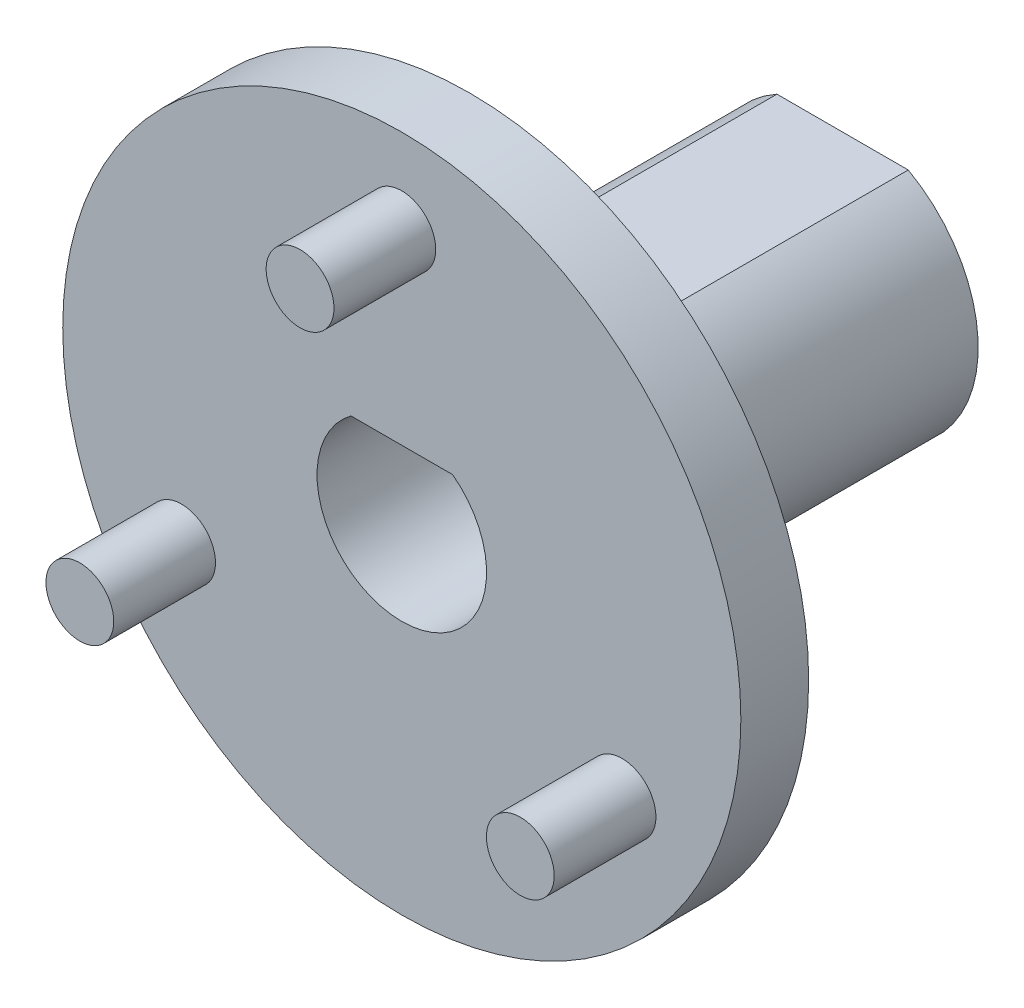
ISO-10303-21;
HEADER;
FILE_DESCRIPTION(('STEP AP214'),'2;1');
FILE_NAME('part.step','',(''),(''),'','','');
FILE_SCHEMA(('AUTOMOTIVE_DESIGN { 1 0 10303 214 1 1 1 1 }'));
ENDSEC;
DATA;
#1=APPLICATION_CONTEXT('core data for automotive mechanical design processes');
#2=APPLICATION_PROTOCOL_DEFINITION('international standard','automotive_design',2000,#1);
#3=PRODUCT_CONTEXT('',#1,'mechanical');
#4=PRODUCT('Part','Part','',(#3));
#5=PRODUCT_RELATED_PRODUCT_CATEGORY('part','',(#4));
#6=PRODUCT_DEFINITION_FORMATION('','',#4);
#7=PRODUCT_DEFINITION_CONTEXT('part definition',#1,'design');
#8=PRODUCT_DEFINITION('design','',#6,#7);
#9=PRODUCT_DEFINITION_SHAPE('','',#8);
#10=(LENGTH_UNIT() NAMED_UNIT(*) SI_UNIT(.MILLI.,.METRE.));
#11=(NAMED_UNIT(*) PLANE_ANGLE_UNIT() SI_UNIT($,.RADIAN.));
#12=(NAMED_UNIT(*) SI_UNIT($,.STERADIAN.) SOLID_ANGLE_UNIT());
#13=UNCERTAINTY_MEASURE_WITH_UNIT(LENGTH_MEASURE(1.E-05),#10,'distance_accuracy_value','');
#14=(GEOMETRIC_REPRESENTATION_CONTEXT(3) GLOBAL_UNCERTAINTY_ASSIGNED_CONTEXT((#13)) GLOBAL_UNIT_ASSIGNED_CONTEXT((#10,
#11,#12)) REPRESENTATION_CONTEXT('',''));
#15=CARTESIAN_POINT('',(0.,0.,0.));
#16=DIRECTION('',(0.,0.,1.));
#17=DIRECTION('',(1.,0.,0.));
#18=AXIS2_PLACEMENT_3D('',#15,#16,#17);
#19=CARTESIAN_POINT('',(0.,0.,-2.));
#20=DIRECTION('',(0.,0.,1.));
#21=DIRECTION('',(1.,0.,0.));
#22=AXIS2_PLACEMENT_3D('',#19,#20,#21);
#23=CYLINDRICAL_SURFACE('',#22,10.);
#24=CARTESIAN_POINT('',(0.,0.,-2.));
#25=DIRECTION('',(0.,0.,-1.));
#26=DIRECTION('',(-1.,0.,0.));
#27=AXIS2_PLACEMENT_3D('',#24,#25,#26);
#28=CIRCLE('',#27,10.);
#29=CARTESIAN_POINT('',(-10.,0.,-2.));
#30=VERTEX_POINT('',#29);
#31=EDGE_CURVE('E57',#30,#30,#28,.T.);
#32=ORIENTED_EDGE('',*,*,#31,.F.);
#33=EDGE_LOOP('',(#32));
#34=FACE_BOUND('',#33,.T.);
#35=CARTESIAN_POINT('',(0.,0.,0.));
#36=DIRECTION('',(0.,0.,-1.));
#37=DIRECTION('',(-1.,0.,0.));
#38=AXIS2_PLACEMENT_3D('',#35,#36,#37);
#39=CIRCLE('',#38,10.);
#40=CARTESIAN_POINT('',(-10.,0.,0.));
#41=VERTEX_POINT('',#40);
#42=EDGE_CURVE('E51',#41,#41,#39,.T.);
#43=ORIENTED_EDGE('',*,*,#42,.T.);
#44=EDGE_LOOP('',(#43));
#45=FACE_BOUND('',#44,.T.);
#46=ADVANCED_FACE('F48',(#34,#45),#23,.T.);
#47=CARTESIAN_POINT('',(0.,0.,-2.));
#48=DIRECTION('',(0.,0.,-1.));
#49=DIRECTION('',(-1.,0.,0.));
#50=AXIS2_PLACEMENT_3D('',#47,#48,#49);
#51=PLANE('',#50);
#52=CARTESIAN_POINT('',(0.,0.,-2.));
#53=DIRECTION('',(0.,0.,-1.));
#54=DIRECTION('',(-1.,0.,0.));
#55=AXIS2_PLACEMENT_3D('',#52,#53,#54);
#56=CIRCLE('',#55,5.);
#57=CARTESIAN_POINT('',(-5.,0.,-2.));
#58=VERTEX_POINT('',#57);
#59=EDGE_CURVE('E12',#58,#58,#56,.T.);
#60=ORIENTED_EDGE('',*,*,#59,.F.);
#61=EDGE_LOOP('',(#60));
#62=FACE_BOUND('',#61,.T.);
#63=ORIENTED_EDGE('',*,*,#31,.T.);
#64=EDGE_LOOP('',(#63));
#65=FACE_BOUND('',#64,.T.);
#66=ADVANCED_FACE('F152',(#62,#65),#51,.T.);
#67=CARTESIAN_POINT('',(0.,0.,0.));
#68=DIRECTION('',(0.,0.,-1.));
#69=DIRECTION('',(-1.,0.,0.));
#70=AXIS2_PLACEMENT_3D('',#67,#68,#69);
#71=PLANE('',#70);
#72=DIRECTION('',(1.,0.,0.));
#73=VECTOR('',#72,1.);
#74=CARTESIAN_POINT('',(0.,2.,0.));
#75=LINE('',#74,#73);
#76=CARTESIAN_POINT('',(-1.5,2.,0.));
#77=VERTEX_POINT('',#76);
#78=CARTESIAN_POINT('',(1.5,2.,0.));
#79=VERTEX_POINT('',#78);
#80=EDGE_CURVE('E94',#77,#79,#75,.T.);
#81=ORIENTED_EDGE('',*,*,#80,.T.);
#82=CARTESIAN_POINT('',(0.,0.,0.));
#83=DIRECTION('',(0.,0.,-1.));
#84=DIRECTION('',(-1.,0.,0.));
#85=AXIS2_PLACEMENT_3D('',#82,#83,#84);
#86=CIRCLE('',#85,2.5);
#87=EDGE_CURVE('E91',#79,#77,#86,.T.);
#88=ORIENTED_EDGE('',*,*,#87,.T.);
#89=EDGE_LOOP('',(#81,#88));
#90=FACE_BOUND('',#89,.T.);
#91=ORIENTED_EDGE('',*,*,#42,.F.);
#92=EDGE_LOOP('',(#91));
#93=FACE_BOUND('',#92,.T.);
#94=ADVANCED_FACE('F149',(#90,#93),#71,.F.);
#95=CARTESIAN_POINT('',(0.,0.,-3.));
#96=DIRECTION('',(0.,0.,1.));
#97=DIRECTION('',(1.,0.,0.));
#98=AXIS2_PLACEMENT_3D('',#95,#96,#97);
#99=CYLINDRICAL_SURFACE('',#98,5.);
#100=CARTESIAN_POINT('',(0.,0.,-3.));
#101=DIRECTION('',(0.,0.,-1.));
#102=DIRECTION('',(-1.,0.,0.));
#103=AXIS2_PLACEMENT_3D('',#100,#101,#102);
#104=CIRCLE('',#103,5.);
#105=CARTESIAN_POINT('',(-5.,0.,-3.));
#106=VERTEX_POINT('',#105);
#107=EDGE_CURVE('E137',#106,#106,#104,.T.);
#108=ORIENTED_EDGE('',*,*,#107,.F.);
#109=EDGE_LOOP('',(#108));
#110=FACE_BOUND('',#109,.T.);
#111=ORIENTED_EDGE('',*,*,#59,.T.);
#112=EDGE_LOOP('',(#111));
#113=FACE_BOUND('',#112,.T.);
#114=ADVANCED_FACE('F151',(#110,#113),#99,.T.);
#115=CARTESIAN_POINT('',(0.,0.,-3.));
#116=DIRECTION('',(0.,0.,-1.));
#117=DIRECTION('',(-1.,0.,0.));
#118=AXIS2_PLACEMENT_3D('',#115,#116,#117);
#119=PLANE('',#118);
#120=CARTESIAN_POINT('',(0.,0.,-3.));
#121=DIRECTION('',(0.,0.,-1.));
#122=DIRECTION('',(-1.,0.,0.));
#123=AXIS2_PLACEMENT_3D('',#120,#121,#122);
#124=CIRCLE('',#123,4.);
#125=CARTESIAN_POINT('',(1.93649167310371,3.5,-3.));
#126=VERTEX_POINT('',#125);
#127=CARTESIAN_POINT('',(-1.93649167310371,3.5,-3.));
#128=VERTEX_POINT('',#127);
#129=EDGE_CURVE('E114',#126,#128,#124,.T.);
#130=ORIENTED_EDGE('',*,*,#129,.F.);
#131=DIRECTION('',(1.,0.,0.));
#132=VECTOR('',#131,1.);
#133=CARTESIAN_POINT('',(1.93649167310371,3.5,-3.));
#134=LINE('',#133,#132);
#135=EDGE_CURVE('E120',#128,#126,#134,.T.);
#136=ORIENTED_EDGE('',*,*,#135,.F.);
#137=EDGE_LOOP('',(#130,#136));
#138=FACE_BOUND('',#137,.T.);
#139=ORIENTED_EDGE('',*,*,#107,.T.);
#140=EDGE_LOOP('',(#139));
#141=FACE_BOUND('',#140,.T.);
#142=ADVANCED_FACE('F158',(#138,#141),#119,.T.);
#143=CARTESIAN_POINT('',(0.,0.,-13.));
#144=DIRECTION('',(0.,0.,1.));
#145=DIRECTION('',(1.,0.,0.));
#146=AXIS2_PLACEMENT_3D('',#143,#144,#145);
#147=CYLINDRICAL_SURFACE('',#146,4.);
#148=ORIENTED_EDGE('',*,*,#129,.T.);
#149=DIRECTION('',(0.,0.,1.));
#150=VECTOR('',#149,1.);
#151=CARTESIAN_POINT('',(-1.93649167310371,3.5,-13.));
#152=LINE('',#151,#150);
#153=CARTESIAN_POINT('',(-1.93649167310371,3.5,-13.));
#154=VERTEX_POINT('',#153);
#155=EDGE_CURVE('E133',#154,#128,#152,.T.);
#156=ORIENTED_EDGE('',*,*,#155,.F.);
#157=CARTESIAN_POINT('',(0.,0.,-13.));
#158=DIRECTION('',(0.,0.,-1.));
#159=DIRECTION('',(-1.,0.,0.));
#160=AXIS2_PLACEMENT_3D('',#157,#158,#159);
#161=CIRCLE('',#160,4.);
#162=CARTESIAN_POINT('',(1.93649167310371,3.5,-13.));
#163=VERTEX_POINT('',#162);
#164=EDGE_CURVE('E115',#163,#154,#161,.T.);
#165=ORIENTED_EDGE('',*,*,#164,.F.);
#166=DIRECTION('',(0.,0.,1.));
#167=VECTOR('',#166,1.);
#168=CARTESIAN_POINT('',(1.93649167310371,3.5,-13.));
#169=LINE('',#168,#167);
#170=EDGE_CURVE('E123',#163,#126,#169,.T.);
#171=ORIENTED_EDGE('',*,*,#170,.T.);
#172=EDGE_LOOP('',(#148,#156,#165,#171));
#173=FACE_BOUND('',#172,.T.);
#174=ADVANCED_FACE('F187',(#173),#147,.T.);
#175=CARTESIAN_POINT('',(1.93649167310371,3.5,-13.));
#176=DIRECTION('',(0.,-1.,0.));
#177=DIRECTION('',(0.,0.,-1.));
#178=AXIS2_PLACEMENT_3D('',#175,#176,#177);
#179=PLANE('',#178);
#180=ORIENTED_EDGE('',*,*,#135,.T.);
#181=ORIENTED_EDGE('',*,*,#170,.F.);
#182=DIRECTION('',(1.,0.,0.));
#183=VECTOR('',#182,1.);
#184=CARTESIAN_POINT('',(1.93649167310371,3.5,-13.));
#185=LINE('',#184,#183);
#186=EDGE_CURVE('E119',#154,#163,#185,.T.);
#187=ORIENTED_EDGE('',*,*,#186,.F.);
#188=ORIENTED_EDGE('',*,*,#155,.T.);
#189=EDGE_LOOP('',(#180,#181,#187,#188));
#190=FACE_BOUND('',#189,.T.);
#191=ADVANCED_FACE('F197',(#190),#179,.F.);
#192=CARTESIAN_POINT('',(0.,0.,-13.));
#193=DIRECTION('',(0.,0.,-1.));
#194=DIRECTION('',(-1.,0.,0.));
#195=AXIS2_PLACEMENT_3D('',#192,#193,#194);
#196=PLANE('',#195);
#197=CARTESIAN_POINT('',(0.,0.,-13.));
#198=DIRECTION('',(0.,0.,-1.));
#199=DIRECTION('',(-1.,0.,0.));
#200=AXIS2_PLACEMENT_3D('',#197,#198,#199);
#201=CIRCLE('',#200,2.5);
#202=CARTESIAN_POINT('',(1.5,2.,-13.));
#203=VERTEX_POINT('',#202);
#204=CARTESIAN_POINT('',(-1.5,2.,-13.));
#205=VERTEX_POINT('',#204);
#206=EDGE_CURVE('E72',#203,#205,#201,.T.);
#207=ORIENTED_EDGE('',*,*,#206,.F.);
#208=DIRECTION('',(1.,0.,0.));
#209=VECTOR('',#208,1.);
#210=CARTESIAN_POINT('',(1.5,2.,-13.));
#211=LINE('',#210,#209);
#212=EDGE_CURVE('E98',#205,#203,#211,.T.);
#213=ORIENTED_EDGE('',*,*,#212,.F.);
#214=EDGE_LOOP('',(#207,#213));
#215=FACE_BOUND('',#214,.T.);
#216=ORIENTED_EDGE('',*,*,#164,.T.);
#217=ORIENTED_EDGE('',*,*,#186,.T.);
#218=EDGE_LOOP('',(#216,#217));
#219=FACE_BOUND('',#218,.T.);
#220=ADVANCED_FACE('F103',(#215,#219),#196,.T.);
#221=CARTESIAN_POINT('',(0.,0.,11.));
#222=DIRECTION('',(0.,0.,-1.));
#223=DIRECTION('',(-1.,0.,0.));
#224=AXIS2_PLACEMENT_3D('',#221,#222,#223);
#225=CYLINDRICAL_SURFACE('',#224,2.5);
#226=DIRECTION('',(0.,0.,-1.));
#227=VECTOR('',#226,1.);
#228=CARTESIAN_POINT('',(1.5,2.,11.));
#229=LINE('',#228,#227);
#230=EDGE_CURVE('E65',#79,#203,#229,.T.);
#231=ORIENTED_EDGE('',*,*,#230,.T.);
#232=ORIENTED_EDGE('',*,*,#206,.T.);
#233=DIRECTION('',(0.,0.,-1.));
#234=VECTOR('',#233,1.);
#235=CARTESIAN_POINT('',(-1.5,2.,11.));
#236=LINE('',#235,#234);
#237=EDGE_CURVE('E95',#77,#205,#236,.T.);
#238=ORIENTED_EDGE('',*,*,#237,.F.);
#239=ORIENTED_EDGE('',*,*,#87,.F.);
#240=EDGE_LOOP('',(#231,#232,#238,#239));
#241=FACE_BOUND('',#240,.T.);
#242=ADVANCED_FACE('F89',(#241),#225,.F.);
#243=CARTESIAN_POINT('',(1.5,2.,11.));
#244=DIRECTION('',(0.,1.,0.));
#245=DIRECTION('',(0.,0.,1.));
#246=AXIS2_PLACEMENT_3D('',#243,#244,#245);
#247=PLANE('',#246);
#248=ORIENTED_EDGE('',*,*,#237,.T.);
#249=ORIENTED_EDGE('',*,*,#212,.T.);
#250=ORIENTED_EDGE('',*,*,#230,.F.);
#251=ORIENTED_EDGE('',*,*,#80,.F.);
#252=EDGE_LOOP('',(#248,#249,#250,#251));
#253=FACE_BOUND('',#252,.T.);
#254=ADVANCED_FACE('F99',(#253),#247,.F.);
#255=CLOSED_SHELL('',(#46,#66,#94,#114,#142,#174,#191,#220,#242,#254));
#256=MANIFOLD_SOLID_BREP('B2',#255);
#257=CARTESIAN_POINT('',(-6.49519052838281,-3.75000000000028,3.));
#258=DIRECTION('',(0.,0.,-1.));
#259=DIRECTION('',(-1.,0.,0.));
#260=AXIS2_PLACEMENT_3D('',#257,#258,#259);
#261=CYLINDRICAL_SURFACE('',#260,1.00000000000061);
#262=CARTESIAN_POINT('',(-6.49519052838281,-3.75000000000028,3.));
#263=DIRECTION('',(0.,0.,1.));
#264=DIRECTION('',(1.,0.,0.));
#265=AXIS2_PLACEMENT_3D('',#262,#263,#264);
#266=CIRCLE('',#265,1.00000000000061);
#267=CARTESIAN_POINT('',(-5.4951905283822,-3.75000000000028,3.));
#268=VERTEX_POINT('',#267);
#269=EDGE_CURVE('E47',#268,#268,#266,.T.);
#270=ORIENTED_EDGE('',*,*,#269,.F.);
#271=EDGE_LOOP('',(#270));
#272=FACE_BOUND('',#271,.T.);
#273=CARTESIAN_POINT('',(-6.49519052838281,-3.75000000000028,0.));
#274=DIRECTION('',(0.,0.,1.));
#275=DIRECTION('',(1.,0.,0.));
#276=AXIS2_PLACEMENT_3D('',#273,#274,#275);
#277=CIRCLE('',#276,1.00000000000061);
#278=CARTESIAN_POINT('',(-5.4951905283822,-3.75000000000028,0.));
#279=VERTEX_POINT('',#278);
#280=EDGE_CURVE('E261',#279,#279,#277,.T.);
#281=ORIENTED_EDGE('',*,*,#280,.T.);
#282=EDGE_LOOP('',(#281));
#283=FACE_BOUND('',#282,.T.);
#284=ADVANCED_FACE('F258',(#272,#283),#261,.T.);
#285=CARTESIAN_POINT('',(-6.49519052838281,-3.75000000000028,3.));
#286=DIRECTION('',(0.,0.,1.));
#287=DIRECTION('',(1.,0.,0.));
#288=AXIS2_PLACEMENT_3D('',#285,#286,#287);
#289=PLANE('',#288);
#290=ORIENTED_EDGE('',*,*,#269,.T.);
#291=EDGE_LOOP('',(#290));
#292=FACE_BOUND('',#291,.T.);
#293=ADVANCED_FACE('F273',(#292),#289,.T.);
#294=CARTESIAN_POINT('',(-6.49519052838281,-3.75000000000028,0.));
#295=DIRECTION('',(0.,0.,1.));
#296=DIRECTION('',(1.,0.,0.));
#297=AXIS2_PLACEMENT_3D('',#294,#295,#296);
#298=PLANE('',#297);
#299=ORIENTED_EDGE('',*,*,#280,.F.);
#300=EDGE_LOOP('',(#299));
#301=FACE_BOUND('',#300,.T.);
#302=ADVANCED_FACE('F271',(#301),#298,.F.);
#303=CLOSED_SHELL('',(#284,#293,#302));
#304=MANIFOLD_SOLID_BREP('B6',#303);
#305=CARTESIAN_POINT('',(6.49519052838377,-3.74999999999972,3.));
#306=DIRECTION('',(0.,0.,-1.));
#307=DIRECTION('',(-1.,0.,0.));
#308=AXIS2_PLACEMENT_3D('',#305,#306,#307);
#309=CYLINDRICAL_SURFACE('',#308,1.00000000000041);
#310=CARTESIAN_POINT('',(6.49519052838377,-3.74999999999972,3.));
#311=DIRECTION('',(0.,0.,1.));
#312=DIRECTION('',(1.,0.,0.));
#313=AXIS2_PLACEMENT_3D('',#310,#311,#312);
#314=CIRCLE('',#313,1.00000000000041);
#315=CARTESIAN_POINT('',(7.49519052838418,-3.74999999999972,3.));
#316=VERTEX_POINT('',#315);
#317=EDGE_CURVE('E257',#316,#316,#314,.T.);
#318=ORIENTED_EDGE('',*,*,#317,.F.);
#319=EDGE_LOOP('',(#318));
#320=FACE_BOUND('',#319,.T.);
#321=CARTESIAN_POINT('',(6.49519052838377,-3.74999999999972,0.));
#322=DIRECTION('',(0.,0.,1.));
#323=DIRECTION('',(1.,0.,0.));
#324=AXIS2_PLACEMENT_3D('',#321,#322,#323);
#325=CIRCLE('',#324,1.00000000000041);
#326=CARTESIAN_POINT('',(7.49519052838418,-3.74999999999972,0.));
#327=VERTEX_POINT('',#326);
#328=EDGE_CURVE('E309',#327,#327,#325,.T.);
#329=ORIENTED_EDGE('',*,*,#328,.T.);
#330=EDGE_LOOP('',(#329));
#331=FACE_BOUND('',#330,.T.);
#332=ADVANCED_FACE('F306',(#320,#331),#309,.T.);
#333=CARTESIAN_POINT('',(6.49519052838377,-3.74999999999972,3.));
#334=DIRECTION('',(0.,0.,1.));
#335=DIRECTION('',(1.,0.,0.));
#336=AXIS2_PLACEMENT_3D('',#333,#334,#335);
#337=PLANE('',#336);
#338=ORIENTED_EDGE('',*,*,#317,.T.);
#339=EDGE_LOOP('',(#338));
#340=FACE_BOUND('',#339,.T.);
#341=ADVANCED_FACE('F321',(#340),#337,.T.);
#342=CARTESIAN_POINT('',(6.49519052838377,-3.74999999999972,0.));
#343=DIRECTION('',(0.,0.,1.));
#344=DIRECTION('',(1.,0.,0.));
#345=AXIS2_PLACEMENT_3D('',#342,#343,#344);
#346=PLANE('',#345);
#347=ORIENTED_EDGE('',*,*,#328,.F.);
#348=EDGE_LOOP('',(#347));
#349=FACE_BOUND('',#348,.T.);
#350=ADVANCED_FACE('F319',(#349),#346,.F.);
#351=CLOSED_SHELL('',(#332,#341,#350));
#352=MANIFOLD_SOLID_BREP('B42',#351);
#353=CARTESIAN_POINT('',(0.,7.5,3.));
#354=DIRECTION('',(0.,0.,-1.));
#355=DIRECTION('',(-1.,0.,0.));
#356=AXIS2_PLACEMENT_3D('',#353,#354,#355);
#357=CYLINDRICAL_SURFACE('',#356,0.999999999999998);
#358=CARTESIAN_POINT('',(0.,7.5,3.));
#359=DIRECTION('',(0.,0.,1.));
#360=DIRECTION('',(1.,0.,0.));
#361=AXIS2_PLACEMENT_3D('',#358,#359,#360);
#362=CIRCLE('',#361,0.999999999999998);
#363=CARTESIAN_POINT('',(0.999999999999998,7.5,3.));
#364=VERTEX_POINT('',#363);
#365=EDGE_CURVE('E305',#364,#364,#362,.T.);
#366=ORIENTED_EDGE('',*,*,#365,.F.);
#367=EDGE_LOOP('',(#366));
#368=FACE_BOUND('',#367,.T.);
#369=CARTESIAN_POINT('',(0.,7.5,0.));
#370=DIRECTION('',(0.,0.,1.));
#371=DIRECTION('',(1.,0.,0.));
#372=AXIS2_PLACEMENT_3D('',#369,#370,#371);
#373=CIRCLE('',#372,0.999999999999998);
#374=CARTESIAN_POINT('',(0.999999999999998,7.5,0.));
#375=VERTEX_POINT('',#374);
#376=EDGE_CURVE('E350',#375,#375,#373,.T.);
#377=ORIENTED_EDGE('',*,*,#376,.T.);
#378=EDGE_LOOP('',(#377));
#379=FACE_BOUND('',#378,.T.);
#380=ADVANCED_FACE('F347',(#368,#379),#357,.T.);
#381=CARTESIAN_POINT('',(0.,7.5,3.));
#382=DIRECTION('',(0.,0.,1.));
#383=DIRECTION('',(1.,0.,0.));
#384=AXIS2_PLACEMENT_3D('',#381,#382,#383);
#385=PLANE('',#384);
#386=ORIENTED_EDGE('',*,*,#365,.T.);
#387=EDGE_LOOP('',(#386));
#388=FACE_BOUND('',#387,.T.);
#389=ADVANCED_FACE('F362',(#388),#385,.T.);
#390=CARTESIAN_POINT('',(0.,7.5,0.));
#391=DIRECTION('',(0.,0.,1.));
#392=DIRECTION('',(1.,0.,0.));
#393=AXIS2_PLACEMENT_3D('',#390,#391,#392);
#394=PLANE('',#393);
#395=ORIENTED_EDGE('',*,*,#376,.F.);
#396=EDGE_LOOP('',(#395));
#397=FACE_BOUND('',#396,.T.);
#398=ADVANCED_FACE('F360',(#397),#394,.F.);
#399=CLOSED_SHELL('',(#380,#389,#398));
#400=MANIFOLD_SOLID_BREP('B252',#399);
#401=ADVANCED_BREP_SHAPE_REPRESENTATION('',(#18,#256,#304,#352,#400),#14);
#402=SHAPE_DEFINITION_REPRESENTATION(#9,#401);
ENDSEC;
END-ISO-10303-21;
